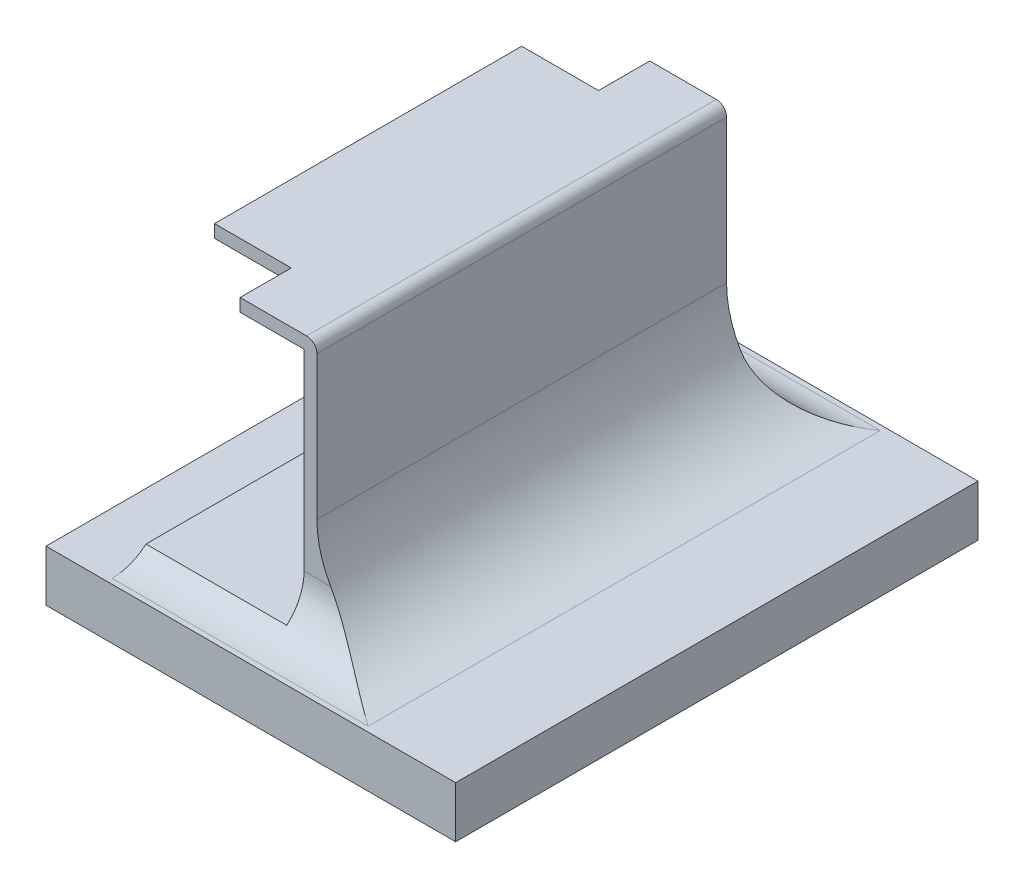
ISO-10303-21;
HEADER;
FILE_DESCRIPTION(('STEP AP214'),'2;1');
FILE_NAME('part.step','',(''),(''),'','','');
FILE_SCHEMA(('AUTOMOTIVE_DESIGN { 1 0 10303 214 1 1 1 1 }'));
ENDSEC;
DATA;
#1=APPLICATION_CONTEXT('core data for automotive mechanical design processes');
#2=APPLICATION_PROTOCOL_DEFINITION('international standard','automotive_design',2000,#1);
#3=PRODUCT_CONTEXT('',#1,'mechanical');
#4=PRODUCT('Part','Part','',(#3));
#5=PRODUCT_RELATED_PRODUCT_CATEGORY('part','',(#4));
#6=PRODUCT_DEFINITION_FORMATION('','',#4);
#7=PRODUCT_DEFINITION_CONTEXT('part definition',#1,'design');
#8=PRODUCT_DEFINITION('design','',#6,#7);
#9=PRODUCT_DEFINITION_SHAPE('','',#8);
#10=(LENGTH_UNIT() NAMED_UNIT(*) SI_UNIT(.MILLI.,.METRE.));
#11=(NAMED_UNIT(*) PLANE_ANGLE_UNIT() SI_UNIT($,.RADIAN.));
#12=(NAMED_UNIT(*) SI_UNIT($,.STERADIAN.) SOLID_ANGLE_UNIT());
#13=UNCERTAINTY_MEASURE_WITH_UNIT(LENGTH_MEASURE(1.E-05),#10,'distance_accuracy_value','');
#14=(GEOMETRIC_REPRESENTATION_CONTEXT(3) GLOBAL_UNCERTAINTY_ASSIGNED_CONTEXT((#13)) GLOBAL_UNIT_ASSIGNED_CONTEXT((#10,
#11,#12)) REPRESENTATION_CONTEXT('',''));
#15=CARTESIAN_POINT('',(0.,0.,0.));
#16=DIRECTION('',(0.,0.,1.));
#17=DIRECTION('',(1.,0.,0.));
#18=AXIS2_PLACEMENT_3D('',#15,#16,#17);
#19=CARTESIAN_POINT('',(0.65,0.575,0.3));
#20=DIRECTION('',(0.,0.,-1.));
#21=DIRECTION('',(-1.,0.,0.));
#22=AXIS2_PLACEMENT_3D('',#19,#20,#21);
#23=PLANE('',#22);
#24=DIRECTION('',(0.,1.,0.));
#25=VECTOR('',#24,1.);
#26=CARTESIAN_POINT('',(0.65,0.575,0.3));
#27=LINE('',#26,#25);
#28=CARTESIAN_POINT('',(0.65,0.575,0.3));
#29=VERTEX_POINT('',#28);
#30=CARTESIAN_POINT('',(0.649999999986111,0.6,0.3));
#31=VERTEX_POINT('',#30);
#32=EDGE_CURVE('E206',#29,#31,#27,.T.);
#33=ORIENTED_EDGE('',*,*,#32,.T.);
#34=DIRECTION('',(1.,0.,0.));
#35=VECTOR('',#34,1.);
#36=CARTESIAN_POINT('',(0.5,0.6,0.3));
#37=LINE('',#36,#35);
#38=CARTESIAN_POINT('',(0.5,0.6,0.3));
#39=VERTEX_POINT('',#38);
#40=EDGE_CURVE('E205',#31,#39,#37,.F.);
#41=ORIENTED_EDGE('',*,*,#40,.T.);
#42=DIRECTION('',(0.,1.,0.));
#43=VECTOR('',#42,1.);
#44=CARTESIAN_POINT('',(0.5,0.575,0.3));
#45=LINE('',#44,#43);
#46=CARTESIAN_POINT('',(0.5,0.575,0.3));
#47=VERTEX_POINT('',#46);
#48=EDGE_CURVE('E252',#39,#47,#45,.F.);
#49=ORIENTED_EDGE('',*,*,#48,.T.);
#50=DIRECTION('',(1.,0.,0.));
#51=VECTOR('',#50,1.);
#52=CARTESIAN_POINT('',(0.5,0.575,0.3));
#53=LINE('',#52,#51);
#54=EDGE_CURVE('E226',#47,#29,#53,.T.);
#55=ORIENTED_EDGE('',*,*,#54,.T.);
#56=EDGE_LOOP('',(#33,#41,#49,#55));
#57=FACE_BOUND('',#56,.T.);
#58=ADVANCED_FACE('F17',(#57),#23,.F.);
#59=CARTESIAN_POINT('',(0.5,0.575,0.3));
#60=DIRECTION('',(1.,0.,0.));
#61=DIRECTION('',(0.,0.,-1.));
#62=AXIS2_PLACEMENT_3D('',#59,#60,#61);
#63=PLANE('',#62);
#64=DIRECTION('',(0.,1.,0.));
#65=VECTOR('',#64,1.);
#66=CARTESIAN_POINT('',(0.5,0.575,-0.3));
#67=LINE('',#66,#65);
#68=CARTESIAN_POINT('',(0.5,0.6,-0.3));
#69=VERTEX_POINT('',#68);
#70=CARTESIAN_POINT('',(0.5,0.575,-0.3));
#71=VERTEX_POINT('',#70);
#72=EDGE_CURVE('E245',#69,#71,#67,.F.);
#73=ORIENTED_EDGE('',*,*,#72,.T.);
#74=DIRECTION('',(0.,0.,1.));
#75=VECTOR('',#74,1.);
#76=CARTESIAN_POINT('',(0.5,0.575,-0.4));
#77=LINE('',#76,#75);
#78=EDGE_CURVE('E236',#71,#47,#77,.T.);
#79=ORIENTED_EDGE('',*,*,#78,.T.);
#80=ORIENTED_EDGE('',*,*,#48,.F.);
#81=DIRECTION('',(0.,0.,-1.));
#82=VECTOR('',#81,1.);
#83=CARTESIAN_POINT('',(0.5,0.6,0.4));
#84=LINE('',#83,#82);
#85=EDGE_CURVE('E240',#39,#69,#84,.T.);
#86=ORIENTED_EDGE('',*,*,#85,.T.);
#87=EDGE_LOOP('',(#73,#79,#80,#86));
#88=FACE_BOUND('',#87,.T.);
#89=ADVANCED_FACE('F578',(#88),#63,.F.);
#90=CARTESIAN_POINT('',(0.5,0.575,-0.3));
#91=DIRECTION('',(0.,0.,1.));
#92=DIRECTION('',(1.,0.,0.));
#93=AXIS2_PLACEMENT_3D('',#90,#91,#92);
#94=PLANE('',#93);
#95=ORIENTED_EDGE('',*,*,#72,.F.);
#96=DIRECTION('',(1.,0.,0.));
#97=VECTOR('',#96,1.);
#98=CARTESIAN_POINT('',(0.5,0.6,-0.3));
#99=LINE('',#98,#97);
#100=CARTESIAN_POINT('',(0.650000000008889,0.6,-0.3));
#101=VERTEX_POINT('',#100);
#102=EDGE_CURVE('E232',#69,#101,#99,.T.);
#103=ORIENTED_EDGE('',*,*,#102,.T.);
#104=DIRECTION('',(0.,1.,0.));
#105=VECTOR('',#104,1.);
#106=CARTESIAN_POINT('',(0.65,0.575,-0.3));
#107=LINE('',#106,#105);
#108=CARTESIAN_POINT('',(0.649999999990741,0.575,-0.3));
#109=VERTEX_POINT('',#108);
#110=EDGE_CURVE('E243',#101,#109,#107,.F.);
#111=ORIENTED_EDGE('',*,*,#110,.T.);
#112=DIRECTION('',(1.,0.,0.));
#113=VECTOR('',#112,1.);
#114=CARTESIAN_POINT('',(0.5,0.575,-0.3));
#115=LINE('',#114,#113);
#116=EDGE_CURVE('E225',#109,#71,#115,.F.);
#117=ORIENTED_EDGE('',*,*,#116,.T.);
#118=EDGE_LOOP('',(#95,#103,#111,#117));
#119=FACE_BOUND('',#118,.T.);
#120=ADVANCED_FACE('F569',(#119),#94,.F.);
#121=CARTESIAN_POINT('',(0.65,0.575,-0.3));
#122=DIRECTION('',(1.,0.,0.));
#123=DIRECTION('',(0.,0.,-1.));
#124=AXIS2_PLACEMENT_3D('',#121,#122,#123);
#125=PLANE('',#124);
#126=ORIENTED_EDGE('',*,*,#110,.F.);
#127=DIRECTION('',(0.,0.,-1.));
#128=VECTOR('',#127,1.);
#129=CARTESIAN_POINT('',(0.650000000013333,0.6,0.4));
#130=LINE('',#129,#128);
#131=CARTESIAN_POINT('',(0.649999999990556,0.6,-0.4));
#132=VERTEX_POINT('',#131);
#133=EDGE_CURVE('E193',#101,#132,#130,.T.);
#134=ORIENTED_EDGE('',*,*,#133,.T.);
#135=DIRECTION('',(0.,1.,0.));
#136=VECTOR('',#135,1.);
#137=CARTESIAN_POINT('',(0.649999999979167,0.2,-0.4));
#138=LINE('',#137,#136);
#139=CARTESIAN_POINT('',(0.649999999979167,0.575,-0.4));
#140=VERTEX_POINT('',#139);
#141=EDGE_CURVE('E165',#140,#132,#138,.T.);
#142=ORIENTED_EDGE('',*,*,#141,.F.);
#143=DIRECTION('',(0.,0.,1.));
#144=VECTOR('',#143,1.);
#145=CARTESIAN_POINT('',(0.649999999979167,0.575,-0.4));
#146=LINE('',#145,#144);
#147=EDGE_CURVE('E222',#140,#109,#146,.T.);
#148=ORIENTED_EDGE('',*,*,#147,.T.);
#149=EDGE_LOOP('',(#126,#134,#142,#148));
#150=FACE_BOUND('',#149,.T.);
#151=ADVANCED_FACE('F560',(#150),#125,.F.);
#152=CARTESIAN_POINT('',(0.5,0.575,-0.4));
#153=DIRECTION('',(0.,1.,0.));
#154=DIRECTION('',(0.,0.,1.));
#155=AXIS2_PLACEMENT_3D('',#152,#153,#154);
#156=PLANE('',#155);
#157=ORIENTED_EDGE('',*,*,#116,.F.);
#158=ORIENTED_EDGE('',*,*,#147,.F.);
#159=DIRECTION('',(-1.,0.,0.));
#160=VECTOR('',#159,1.);
#161=CARTESIAN_POINT('',(0.827855689,0.575,-0.4));
#162=LINE('',#161,#160);
#163=CARTESIAN_POINT('',(0.775000000036869,0.575,-0.4));
#164=VERTEX_POINT('',#163);
#165=EDGE_CURVE('E174',#164,#140,#162,.T.);
#166=ORIENTED_EDGE('',*,*,#165,.F.);
#167=DIRECTION('',(0.,0.,-1.));
#168=VECTOR('',#167,1.);
#169=CARTESIAN_POINT('',(0.775,0.575,0.439062492));
#170=LINE('',#169,#168);
#171=CARTESIAN_POINT('',(0.775000000023,0.575,0.400000000028376));
#172=VERTEX_POINT('',#171);
#173=EDGE_CURVE('E213',#164,#172,#170,.F.);
#174=ORIENTED_EDGE('',*,*,#173,.T.);
#175=DIRECTION('',(-1.,0.,0.));
#176=VECTOR('',#175,1.);
#177=CARTESIAN_POINT('',(0.827855689,0.575,0.4));
#178=LINE('',#177,#176);
#179=CARTESIAN_POINT('',(0.649999999979167,0.575,0.4));
#180=VERTEX_POINT('',#179);
#181=EDGE_CURVE('E199',#172,#180,#178,.T.);
#182=ORIENTED_EDGE('',*,*,#181,.T.);
#183=DIRECTION('',(0.,0.,-1.));
#184=VECTOR('',#183,1.);
#185=CARTESIAN_POINT('',(0.65,0.575,0.4));
#186=LINE('',#185,#184);
#187=EDGE_CURVE('E202',#180,#29,#186,.T.);
#188=ORIENTED_EDGE('',*,*,#187,.T.);
#189=ORIENTED_EDGE('',*,*,#54,.F.);
#190=ORIENTED_EDGE('',*,*,#78,.F.);
#191=EDGE_LOOP('',(#157,#158,#166,#174,#182,#188,#189,#190));
#192=FACE_BOUND('',#191,.T.);
#193=ADVANCED_FACE('F551',(#192),#156,.F.);
#194=CARTESIAN_POINT('',(0.65,0.575,0.4));
#195=DIRECTION('',(1.,0.,0.));
#196=DIRECTION('',(0.,0.,-1.));
#197=AXIS2_PLACEMENT_3D('',#194,#195,#196);
#198=PLANE('',#197);
#199=DIRECTION('',(0.,1.,0.));
#200=VECTOR('',#199,1.);
#201=CARTESIAN_POINT('',(0.64999999996875,0.2,0.4));
#202=LINE('',#201,#200);
#203=CARTESIAN_POINT('',(0.649999999972222,0.6,0.4));
#204=VERTEX_POINT('',#203);
#205=EDGE_CURVE('E196',#180,#204,#202,.T.);
#206=ORIENTED_EDGE('',*,*,#205,.T.);
#207=DIRECTION('',(0.,0.,-1.));
#208=VECTOR('',#207,1.);
#209=CARTESIAN_POINT('',(0.649999999979167,0.6,0.4));
#210=LINE('',#209,#208);
#211=EDGE_CURVE('E190',#204,#31,#210,.T.);
#212=ORIENTED_EDGE('',*,*,#211,.T.);
#213=ORIENTED_EDGE('',*,*,#32,.F.);
#214=ORIENTED_EDGE('',*,*,#187,.F.);
#215=EDGE_LOOP('',(#206,#212,#213,#214));
#216=FACE_BOUND('',#215,.T.);
#217=ADVANCED_FACE('F543',(#216),#198,.F.);
#218=CARTESIAN_POINT('',(0.5,0.6,0.4));
#219=DIRECTION('',(0.,-1.,0.));
#220=DIRECTION('',(0.,0.,-1.));
#221=AXIS2_PLACEMENT_3D('',#218,#219,#220);
#222=PLANE('',#221);
#223=DIRECTION('',(-1.,0.,0.));
#224=VECTOR('',#223,1.);
#225=CARTESIAN_POINT('',(0.827855689,0.6,0.4));
#226=LINE('',#225,#224);
#227=CARTESIAN_POINT('',(0.78,0.6,0.4));
#228=VERTEX_POINT('',#227);
#229=EDGE_CURVE('E198',#204,#228,#226,.F.);
#230=ORIENTED_EDGE('',*,*,#229,.T.);
#231=DIRECTION('',(0.,0.,-1.));
#232=VECTOR('',#231,1.);
#233=CARTESIAN_POINT('',(0.78,0.6,0.4));
#234=LINE('',#233,#232);
#235=CARTESIAN_POINT('',(0.78,0.6,-0.4));
#236=VERTEX_POINT('',#235);
#237=EDGE_CURVE('E151',#236,#228,#234,.F.);
#238=ORIENTED_EDGE('',*,*,#237,.F.);
#239=DIRECTION('',(-1.,0.,0.));
#240=VECTOR('',#239,1.);
#241=CARTESIAN_POINT('',(0.827855689,0.6,-0.4));
#242=LINE('',#241,#240);
#243=EDGE_CURVE('E179',#132,#236,#242,.F.);
#244=ORIENTED_EDGE('',*,*,#243,.F.);
#245=ORIENTED_EDGE('',*,*,#133,.F.);
#246=ORIENTED_EDGE('',*,*,#102,.F.);
#247=ORIENTED_EDGE('',*,*,#85,.F.);
#248=ORIENTED_EDGE('',*,*,#40,.F.);
#249=ORIENTED_EDGE('',*,*,#211,.F.);
#250=EDGE_LOOP('',(#230,#238,#244,#245,#246,#247,#248,#249));
#251=FACE_BOUND('',#250,.T.);
#252=ADVANCED_FACE('F535',(#251),#222,.F.);
#253=CARTESIAN_POINT('',(0.78,0.58,0.4));
#254=DIRECTION('',(0.,0.,-1.));
#255=DIRECTION('',(-1.,0.,0.));
#256=AXIS2_PLACEMENT_3D('',#253,#254,#255);
#257=CYLINDRICAL_SURFACE('',#256,0.0199999999999999);
#258=ORIENTED_EDGE('',*,*,#237,.T.);
#259=CARTESIAN_POINT('',(0.78,0.58,0.4));
#260=DIRECTION('',(0.,0.,-1.));
#261=DIRECTION('',(-1.,0.,0.));
#262=AXIS2_PLACEMENT_3D('',#259,#260,#261);
#263=CIRCLE('',#262,0.0199999999999999);
#264=CARTESIAN_POINT('',(0.8,0.58,0.4));
#265=VERTEX_POINT('',#264);
#266=EDGE_CURVE('E162',#228,#265,#263,.T.);
#267=ORIENTED_EDGE('',*,*,#266,.T.);
#268=DIRECTION('',(0.,0.,1.));
#269=VECTOR('',#268,1.);
#270=CARTESIAN_POINT('',(0.8,0.58,-0.4));
#271=LINE('',#270,#269);
#272=CARTESIAN_POINT('',(0.800000000021836,0.58,-0.4));
#273=VERTEX_POINT('',#272);
#274=EDGE_CURVE('E156',#265,#273,#271,.F.);
#275=ORIENTED_EDGE('',*,*,#274,.T.);
#276=CARTESIAN_POINT('',(0.78,0.58,-0.4));
#277=DIRECTION('',(0.,0.,-1.));
#278=DIRECTION('',(-1.,0.,0.));
#279=AXIS2_PLACEMENT_3D('',#276,#277,#278);
#280=CIRCLE('',#279,0.0199999999999999);
#281=EDGE_CURVE('E20',#236,#273,#280,.T.);
#282=ORIENTED_EDGE('',*,*,#281,.F.);
#283=EDGE_LOOP('',(#258,#267,#275,#282));
#284=FACE_BOUND('',#283,.T.);
#285=ADVANCED_FACE('F158',(#284),#257,.T.);
#286=CARTESIAN_POINT('',(0.8,0.58,-0.4));
#287=DIRECTION('',(-1.,0.,0.));
#288=DIRECTION('',(0.,0.,1.));
#289=AXIS2_PLACEMENT_3D('',#286,#287,#288);
#290=PLANE('',#289);
#291=ORIENTED_EDGE('',*,*,#274,.F.);
#292=DIRECTION('',(0.,1.,0.));
#293=VECTOR('',#292,1.);
#294=CARTESIAN_POINT('',(0.8,0.2,0.4));
#295=LINE('',#294,#293);
#296=CARTESIAN_POINT('',(0.8,0.3,0.400000000000027));
#297=VERTEX_POINT('',#296);
#298=EDGE_CURVE('E318',#265,#297,#295,.F.);
#299=ORIENTED_EDGE('',*,*,#298,.T.);
#300=DIRECTION('',(0.,0.,1.));
#301=VECTOR('',#300,1.);
#302=CARTESIAN_POINT('',(0.8,0.3,-0.506));
#303=LINE('',#302,#301);
#304=CARTESIAN_POINT('',(0.800000000021836,0.3,-0.400000000004));
#305=VERTEX_POINT('',#304);
#306=EDGE_CURVE('E171',#297,#305,#303,.F.);
#307=ORIENTED_EDGE('',*,*,#306,.T.);
#308=DIRECTION('',(0.,1.,0.));
#309=VECTOR('',#308,1.);
#310=CARTESIAN_POINT('',(0.800000000043671,0.2,-0.4));
#311=LINE('',#310,#309);
#312=EDGE_CURVE('E168',#273,#305,#311,.F.);
#313=ORIENTED_EDGE('',*,*,#312,.F.);
#314=EDGE_LOOP('',(#291,#299,#307,#313));
#315=FACE_BOUND('',#314,.T.);
#316=ADVANCED_FACE('F169',(#315),#290,.F.);
#317=CARTESIAN_POINT('',(0.827855689,0.2,-0.4));
#318=DIRECTION('',(0.,0.,-1.));
#319=DIRECTION('',(-1.,0.,0.));
#320=AXIS2_PLACEMENT_3D('',#317,#318,#319);
#321=PLANE('',#320);
#322=DIRECTION('',(0.,1.,0.));
#323=VECTOR('',#322,1.);
#324=CARTESIAN_POINT('',(0.775,0.125,-0.4));
#325=LINE('',#324,#323);
#326=CARTESIAN_POINT('',(0.775000000055303,0.200000000006281,-0.4));
#327=VERTEX_POINT('',#326);
#328=EDGE_CURVE('E215',#327,#164,#325,.T.);
#329=ORIENTED_EDGE('',*,*,#328,.T.);
#330=ORIENTED_EDGE('',*,*,#165,.T.);
#331=ORIENTED_EDGE('',*,*,#141,.T.);
#332=ORIENTED_EDGE('',*,*,#243,.T.);
#333=ORIENTED_EDGE('',*,*,#281,.T.);
#334=ORIENTED_EDGE('',*,*,#312,.T.);
#335=CARTESIAN_POINT('',(1.,0.3,-0.400000000004));
#336=DIRECTION('',(0.,0.,1.));
#337=DIRECTION('',(1.,0.,0.));
#338=AXIS2_PLACEMENT_3D('',#335,#336,#337);
#339=CIRCLE('',#338,0.2);
#340=CARTESIAN_POINT('',(0.826794919235461,0.200000000011846,-0.400000000001054));
#341=VERTEX_POINT('',#340);
#342=EDGE_CURVE('E316',#305,#341,#339,.T.);
#343=ORIENTED_EDGE('',*,*,#342,.T.);
#344=DIRECTION('',(1.,0.,0.));
#345=VECTOR('',#344,1.);
#346=CARTESIAN_POINT('',(0.5,0.200000000012562,-0.4));
#347=LINE('',#346,#345);
#348=EDGE_CURVE('E312',#341,#327,#347,.F.);
#349=ORIENTED_EDGE('',*,*,#348,.T.);
#350=EDGE_LOOP('',(#329,#330,#331,#332,#333,#334,#343,#349));
#351=FACE_BOUND('',#350,.T.);
#352=ADVANCED_FACE('F177',(#351),#321,.T.);
#353=CARTESIAN_POINT('',(0.775,0.125,0.439062492));
#354=DIRECTION('',(1.,0.,0.));
#355=DIRECTION('',(0.,0.,-1.));
#356=AXIS2_PLACEMENT_3D('',#353,#354,#355);
#357=PLANE('',#356);
#358=CARTESIAN_POINT('',(0.775000000023,0.2,0.5));
#359=DIRECTION('',(-1.,0.,0.));
#360=DIRECTION('',(0.,0.,1.));
#361=AXIS2_PLACEMENT_3D('',#358,#359,#360);
#362=CIRCLE('',#361,0.1);
#363=CARTESIAN_POINT('',(0.775000000039151,0.125000000005154,0.433856217211698));
#364=VERTEX_POINT('',#363);
#365=CARTESIAN_POINT('',(0.77500000002875,0.2,0.4));
#366=VERTEX_POINT('',#365);
#367=EDGE_CURVE('E284',#364,#366,#362,.F.);
#368=ORIENTED_EDGE('',*,*,#367,.T.);
#369=DIRECTION('',(0.,1.,0.));
#370=VECTOR('',#369,1.);
#371=CARTESIAN_POINT('',(0.7750000000345,0.2,0.4));
#372=LINE('',#371,#370);
#373=EDGE_CURVE('E210',#366,#172,#372,.T.);
#374=ORIENTED_EDGE('',*,*,#373,.T.);
#375=ORIENTED_EDGE('',*,*,#173,.F.);
#376=ORIENTED_EDGE('',*,*,#328,.F.);
#377=CARTESIAN_POINT('',(0.775000000110606,0.2,-0.5));
#378=DIRECTION('',(1.,0.,0.));
#379=DIRECTION('',(0.,0.,-1.));
#380=AXIS2_PLACEMENT_3D('',#377,#378,#379);
#381=CIRCLE('',#380,0.1);
#382=CARTESIAN_POINT('',(0.775000000082955,0.124999999998918,-0.433856217225838));
#383=VERTEX_POINT('',#382);
#384=EDGE_CURVE('E313',#327,#383,#381,.T.);
#385=ORIENTED_EDGE('',*,*,#384,.T.);
#386=DIRECTION('',(0.,0.,-1.));
#387=VECTOR('',#386,1.);
#388=CARTESIAN_POINT('',(0.775000000055303,0.125,0.433856217));
#389=LINE('',#388,#387);
#390=EDGE_CURVE('E317',#383,#364,#389,.F.);
#391=ORIENTED_EDGE('',*,*,#390,.T.);
#392=EDGE_LOOP('',(#368,#374,#375,#376,#385,#391));
#393=FACE_BOUND('',#392,.T.);
#394=ADVANCED_FACE('F506',(#393),#357,.F.);
#395=CARTESIAN_POINT('',(0.827855689,0.2,0.4));
#396=DIRECTION('',(0.,0.,-1.));
#397=DIRECTION('',(-1.,0.,0.));
#398=AXIS2_PLACEMENT_3D('',#395,#396,#397);
#399=PLANE('',#398);
#400=ORIENTED_EDGE('',*,*,#298,.F.);
#401=ORIENTED_EDGE('',*,*,#266,.F.);
#402=ORIENTED_EDGE('',*,*,#229,.F.);
#403=ORIENTED_EDGE('',*,*,#205,.F.);
#404=ORIENTED_EDGE('',*,*,#181,.F.);
#405=ORIENTED_EDGE('',*,*,#373,.F.);
#406=DIRECTION('',(-1.,0.,0.));
#407=VECTOR('',#406,1.);
#408=CARTESIAN_POINT('',(1.003,0.2,0.4));
#409=LINE('',#408,#407);
#410=CARTESIAN_POINT('',(0.826794919243862,0.199999999998,0.400000000000027));
#411=VERTEX_POINT('',#410);
#412=EDGE_CURVE('E283',#366,#411,#409,.F.);
#413=ORIENTED_EDGE('',*,*,#412,.T.);
#414=CARTESIAN_POINT('',(1.,0.3,0.400000000000054));
#415=DIRECTION('',(0.,0.,1.));
#416=DIRECTION('',(1.,0.,0.));
#417=AXIS2_PLACEMENT_3D('',#414,#415,#416);
#418=CIRCLE('',#417,0.2);
#419=EDGE_CURVE('E187',#411,#297,#418,.F.);
#420=ORIENTED_EDGE('',*,*,#419,.T.);
#421=EDGE_LOOP('',(#400,#401,#402,#403,#404,#405,#413,#420));
#422=FACE_BOUND('',#421,.T.);
#423=ADVANCED_FACE('F370',(#422),#399,.F.);
#424=CARTESIAN_POINT('',(0.5,0.125,0.433856217));
#425=DIRECTION('',(0.,-1.,0.));
#426=DIRECTION('',(0.,0.,-1.));
#427=AXIS2_PLACEMENT_3D('',#424,#425,#426);
#428=PLANE('',#427);
#429=DIRECTION('',(-1.,0.,0.));
#430=VECTOR('',#429,1.);
#431=CARTESIAN_POINT('',(1.003,0.125000000020615,0.433856217200011));
#432=LINE('',#431,#430);
#433=CARTESIAN_POINT('',(0.5,0.125000000003993,0.433856217218857));
#434=VERTEX_POINT('',#433);
#435=EDGE_CURVE('E275',#434,#364,#432,.F.);
#436=ORIENTED_EDGE('',*,*,#435,.T.);
#437=ORIENTED_EDGE('',*,*,#390,.F.);
#438=DIRECTION('',(1.,0.,0.));
#439=VECTOR('',#438,1.);
#440=CARTESIAN_POINT('',(0.5,0.124999999995673,-0.433856217228291));
#441=LINE('',#440,#439);
#442=CARTESIAN_POINT('',(0.5,0.124999999991523,-0.433856217232998));
#443=VERTEX_POINT('',#442);
#444=EDGE_CURVE('E334',#383,#443,#441,.F.);
#445=ORIENTED_EDGE('',*,*,#444,.T.);
#446=DIRECTION('',(0.,0.,-1.));
#447=VECTOR('',#446,1.);
#448=CARTESIAN_POINT('',(0.5,0.124999999987372,0.506));
#449=LINE('',#448,#447);
#450=EDGE_CURVE('E340',#443,#434,#449,.F.);
#451=ORIENTED_EDGE('',*,*,#450,.T.);
#452=EDGE_LOOP('',(#436,#437,#445,#451));
#453=FACE_BOUND('',#452,.T.);
#454=ADVANCED_FACE('F493',(#453),#428,.F.);
#455=CARTESIAN_POINT('',(1.,0.3,-0.506));
#456=DIRECTION('',(0.,0.,1.));
#457=DIRECTION('',(1.,0.,0.));
#458=AXIS2_PLACEMENT_3D('',#455,#456,#457);
#459=CYLINDRICAL_SURFACE('',#458,0.2);
#460=ORIENTED_EDGE('',*,*,#419,.F.);
#461=CARTESIAN_POINT('',(0.826794919245219,0.19999999999635,0.4));
#462=CARTESIAN_POINT('',(0.83112053080877,0.192485690399696,0.400008857800515));
#463=CARTESIAN_POINT('',(0.835916451417255,0.185326558494217,0.40084269301661));
#464=CARTESIAN_POINT('',(0.846163216293374,0.171925193453775,0.403779236334651));
#465=CARTESIAN_POINT('',(0.85160419643604,0.165671750272969,0.405864418299191));
#466=CARTESIAN_POINT('',(0.864070184368493,0.152971591018438,0.411426534381074));
#467=CARTESIAN_POINT('',(0.871199452055782,0.146715187138145,0.415092977770635));
#468=CARTESIAN_POINT('',(0.885961995065693,0.13543352691315,0.423317803120075));
#469=CARTESIAN_POINT('',(0.893598068172302,0.130415977703925,0.427881466361019));
#470=CARTESIAN_POINT('',(0.91234089640699,0.119793250205556,0.439567119275444));
#471=CARTESIAN_POINT('',(0.923599763507991,0.114774375141445,0.446976253707024));
#472=CARTESIAN_POINT('',(0.94641091774354,0.106936347923723,0.462398506986867));
#473=CARTESIAN_POINT('',(0.957962784578813,0.104114210572105,0.470410789896464));
#474=CARTESIAN_POINT('',(0.978923226484742,0.100889583872477,0.485101135740876));
#475=CARTESIAN_POINT('',(0.988308747217825,0.100121610173948,0.491733388485922));
#476=CARTESIAN_POINT('',(0.998460423973696,0.10000444919043,0.498911355870459));
#477=CARTESIAN_POINT('',(0.999230237064578,0.100000006341012,0.499455696073852));
#478=CARTESIAN_POINT('',(1.,0.1,0.5));
#479=B_SPLINE_CURVE_WITH_KNOTS('',3,(#461,#462,#463,#464,#465,#466,#467,#468,#469,#470,#471,
#472,#473,#474,#475,#476,#477,#478),.UNSPECIFIED.,.F.,.F.,(4,2,2,2,2,2,2,2,4),(0.,
0.025848435767527,0.0513430265915071,0.0816965683549554,0.112234438632135,0.155151467054056,
0.198010072213491,0.232479852219109,0.23530831077353),.UNSPECIFIED.);
#480=CARTESIAN_POINT('',(0.999999999949444,0.1,0.499999999979931));
#481=VERTEX_POINT('',#480);
#482=EDGE_CURVE('E276',#411,#481,#479,.T.);
#483=ORIENTED_EDGE('',*,*,#482,.T.);
#484=DIRECTION('',(0.,0.,-1.));
#485=VECTOR('',#484,1.);
#486=CARTESIAN_POINT('',(0.999999999942053,0.1,0.51));
#487=LINE('',#486,#485);
#488=CARTESIAN_POINT('',(0.999999999971027,0.1,-0.499999999940893));
#489=VERTEX_POINT('',#488);
#490=EDGE_CURVE('E350',#481,#489,#487,.T.);
#491=ORIENTED_EDGE('',*,*,#490,.T.);
#492=CARTESIAN_POINT('',(1.,0.1,-0.5));
#493=CARTESIAN_POINT('',(0.999999999950757,0.0999999999999989,-0.499999611087571));
#494=CARTESIAN_POINT('',(0.999999960309637,0.100000000002983,-0.499999222180235));
#495=CARTESIAN_POINT('',(0.999999819833158,0.100000000013576,-0.499998455075247));
#496=CARTESIAN_POINT('',(0.999999718739186,0.100000000021206,-0.499998076929965));
#497=CARTESIAN_POINT('',(0.999999467705695,0.100000000040176,-0.499997328561973));
#498=CARTESIAN_POINT('',(0.999999316766788,0.100000000051591,-0.499996958682193));
#499=CARTESIAN_POINT('',(0.999998977816325,0.100000000077261,-0.499996237298116));
#500=CARTESIAN_POINT('',(0.999998789844402,0.100000000091512,-0.499995885774677));
#501=CARTESIAN_POINT('',(0.999998151350813,0.100000000139996,-0.499994796371705));
#502=CARTESIAN_POINT('',(0.99999765092133,0.100000000178102,-0.49999408755909));
#503=CARTESIAN_POINT('',(0.999996570049613,0.100000000260817,-0.499992746657266));
#504=CARTESIAN_POINT('',(0.999995990256866,0.100000000305374,-0.499992114016522));
#505=CARTESIAN_POINT('',(0.99999391616441,0.100000000465772,-0.499989998024733));
#506=CARTESIAN_POINT('',(0.999992317996965,0.100000000591055,-0.499988615314596));
#507=CARTESIAN_POINT('',(0.999989012927042,0.10000000085552,-0.4999861283856));
#508=CARTESIAN_POINT('',(0.999987311715668,0.100000000994068,-0.499985016173272));
#509=CARTESIAN_POINT('',(0.99998070596603,0.10000000154339,-0.499980827873058));
#510=CARTESIAN_POINT('',(0.999975695915881,0.100000001983733,-0.499977923941996));
#511=CARTESIAN_POINT('',(0.999965954329992,0.100000003132285,-0.499972776158037));
#512=CARTESIAN_POINT('',(0.99996124253154,0.100000003810566,-0.499970495655661));
#513=CARTESIAN_POINT('',(0.99993027449326,0.100000009470078,-0.499954207358652));
#514=CARTESIAN_POINT('',(0.99990682806375,0.100000019693332,-0.499935451209513));
#515=CARTESIAN_POINT('',(0.999819738982969,0.10000007277886,-0.499868898492914));
#516=CARTESIAN_POINT('',(0.999754070284215,0.100000141647518,-0.499824659324673));
#517=CARTESIAN_POINT('',(0.999513857789269,0.100000511234241,-0.499659861584533));
#518=CARTESIAN_POINT('',(0.999341361617858,0.100001007082031,-0.499535697587748));
#519=CARTESIAN_POINT('',(0.998677533931127,0.100003777447637,-0.499060830210729));
#520=CARTESIAN_POINT('',(0.998184017664401,0.100007645906599,-0.498714006150791));
#521=CARTESIAN_POINT('',(0.9905591670761,0.100095541169794,-0.493352209904531));
#522=CARTESIAN_POINT('',(0.983445439070934,0.100557819227995,-0.488304578293413));
#523=CARTESIAN_POINT('',(0.968715928854648,0.102312815134541,-0.477928778182384));
#524=CARTESIAN_POINT('',(0.961102357875459,0.103665013663881,-0.472607836231599));
#525=CARTESIAN_POINT('',(0.947405353533808,0.106936326254387,-0.463132622700171));
#526=CARTESIAN_POINT('',(0.941305466760091,0.108699370490281,-0.458948407676327));
#527=CARTESIAN_POINT('',(0.929298390450943,0.112808026085937,-0.450827450726562));
#528=CARTESIAN_POINT('',(0.923389686513819,0.115143288853166,-0.446887721614248));
#529=CARTESIAN_POINT('',(0.909315972316054,0.121511885907001,-0.437691027385914));
#530=CARTESIAN_POINT('',(0.901209931684844,0.125849618658978,-0.432549460538511));
#531=CARTESIAN_POINT('',(0.885077743273509,0.136027399077003,-0.42280577952382));
#532=CARTESIAN_POINT('',(0.877065729898019,0.141917234893535,-0.418230773719464));
#533=CARTESIAN_POINT('',(0.863778764165818,0.153376357776948,-0.411355036515902));
#534=CARTESIAN_POINT('',(0.858351102336313,0.158598843592378,-0.408774050086849));
#535=CARTESIAN_POINT('',(0.848013888168205,0.169779195460674,-0.40449004324408));
#536=CARTESIAN_POINT('',(0.843100114255373,0.175730023562761,-0.402779333697915));
#537=CARTESIAN_POINT('',(0.834902731937157,0.186950289326019,-0.400728546166575));
#538=CARTESIAN_POINT('',(0.831496184093592,0.192089575461383,-0.400172330351397));
#539=CARTESIAN_POINT('',(0.825160487884552,0.202690155173211,-0.399895807646621));
#540=CARTESIAN_POINT('',(0.822231753627316,0.208151722539392,-0.400176221825415));
#541=CARTESIAN_POINT('',(0.816918291438751,0.219258267520922,-0.401710947829042));
#542=CARTESIAN_POINT('',(0.814537755490152,0.224904304336692,-0.402972460978123));
#543=CARTESIAN_POINT('',(0.810394020729201,0.236085524417218,-0.40655381113907));
#544=CARTESIAN_POINT('',(0.808630265972195,0.241620803249557,-0.408872690711332));
#545=CARTESIAN_POINT('',(0.805883862889613,0.251603155580046,-0.414181297020485));
#546=CARTESIAN_POINT('',(0.804829530236469,0.256098206008114,-0.417044829891167));
#547=CARTESIAN_POINT('',(0.803106485363544,0.26461855375908,-0.423495256924665));
#548=CARTESIAN_POINT('',(0.802437764365187,0.268643861774152,-0.427082134617791));
#549=CARTESIAN_POINT('',(0.801413901663433,0.275980105313328,-0.434773275029535));
#550=CARTESIAN_POINT('',(0.801050779002098,0.279307397695329,-0.438860948868122));
#551=CARTESIAN_POINT('',(0.800519613122905,0.285282891890224,-0.447516709243242));
#552=CARTESIAN_POINT('',(0.800351593770941,0.287931010592742,-0.45208485447863));
#553=CARTESIAN_POINT('',(0.800123991798605,0.292568902932394,-0.461776728419297));
#554=CARTESIAN_POINT('',(0.800069101956163,0.294527487609981,-0.466915503910398));
#555=CARTESIAN_POINT('',(0.80000882513186,0.297577220573214,-0.477444752234399));
#556=CARTESIAN_POINT('',(0.800003444239286,0.298668262141464,-0.482835255946334));
#557=CARTESIAN_POINT('',(0.799998878478011,0.299968217650134,-0.493850262684544));
#558=CARTESIAN_POINT('',(0.799999841748612,0.300155862581577,-0.499477289081228));
#559=CARTESIAN_POINT('',(0.800000241561195,0.299585869135832,-0.510683449628154));
#560=CARTESIAN_POINT('',(0.799999678007652,0.298828171614764,-0.516262580759915));
#561=CARTESIAN_POINT('',(0.800028952051117,0.296386102641876,-0.527227501771367));
#562=CARTESIAN_POINT('',(0.800058858189019,0.29469964589631,-0.532612827415568));
#563=CARTESIAN_POINT('',(0.800217025275677,0.290446712173501,-0.543023315354239));
#564=CARTESIAN_POINT('',(0.800345291366429,0.28788018919263,-0.548048458804331));
#565=CARTESIAN_POINT('',(0.800793471713846,0.281958341973783,-0.55756817875496));
#566=CARTESIAN_POINT('',(0.801112460241678,0.278606875186651,-0.562065193354219));
#567=CARTESIAN_POINT('',(0.802046850777513,0.27121875215446,-0.570419829992819));
#568=CARTESIAN_POINT('',(0.802662148035391,0.267182338376027,-0.574277677341265));
#569=CARTESIAN_POINT('',(0.80426178612915,0.258714830300239,-0.581124818547735));
#570=CARTESIAN_POINT('',(0.805233370433814,0.254301007857318,-0.584138435407934));
#571=CARTESIAN_POINT('',(0.807612497367612,0.245142152255433,-0.589386945818724));
#572=CARTESIAN_POINT('',(0.809019889676545,0.240397233735598,-0.591622107312518));
#573=CARTESIAN_POINT('',(0.812245856406524,0.230915583590433,-0.595232133694325));
#574=CARTESIAN_POINT('',(0.814049920257968,0.226183396775241,-0.596632112604746));
#575=CARTESIAN_POINT('',(0.818081645256309,0.216740777788967,-0.598707374607518));
#576=CARTESIAN_POINT('',(0.820309515497531,0.212030357536895,-0.599382298880793));
#577=CARTESIAN_POINT('',(0.825286281036745,0.202503347427084,-0.600089105766047));
#578=CARTESIAN_POINT('',(0.828057441505848,0.197695699992215,-0.600082664142484));
#579=CARTESIAN_POINT('',(0.833962080969042,0.188366933762365,-0.599431120689722));
#580=CARTESIAN_POINT('',(0.837095222818916,0.183845554322634,-0.598786608981011));
#581=CARTESIAN_POINT('',(0.845339923167057,0.172925776543115,-0.5964988705745));
#582=CARTESIAN_POINT('',(0.85064598790899,0.166745111718743,-0.594514061398149));
#583=CARTESIAN_POINT('',(0.861805269387901,0.155197818045603,-0.589624745966487));
#584=CARTESIAN_POINT('',(0.867663793747403,0.149840739581501,-0.586710503446962));
#585=CARTESIAN_POINT('',(0.88238894282894,0.137848508449974,-0.578797851596849));
#586=CARTESIAN_POINT('',(0.89144758006182,0.131683873068247,-0.57344601396098));
#587=CARTESIAN_POINT('',(0.909611715514509,0.121296277318067,-0.562146275150674));
#588=CARTESIAN_POINT('',(0.918699653850915,0.117003329574732,-0.556232345935757));
#589=CARTESIAN_POINT('',(0.933025483703562,0.111467581711108,-0.546664550389309));
#590=CARTESIAN_POINT('',(0.938182224042145,0.109716632368019,-0.543172364193356));
#591=CARTESIAN_POINT('',(0.948641616574635,0.106628357629541,-0.536016279853844));
#592=CARTESIAN_POINT('',(0.953945245373413,0.105298773587451,-0.532350449720539));
#593=CARTESIAN_POINT('',(0.965864198722438,0.10281968511778,-0.524061904481932));
#594=CARTESIAN_POINT('',(0.972490501504934,0.101788878929114,-0.519419609233472));
#595=CARTESIAN_POINT('',(0.985303688948704,0.100443766254518,-0.51038311285586));
#596=CARTESIAN_POINT('',(0.991489257583479,0.100084822822337,-0.505993967934314));
#597=CARTESIAN_POINT('',(0.998183744060762,0.100007648802347,-0.501286168951242));
#598=CARTESIAN_POINT('',(0.998677001692416,0.10000378158636,-0.500939540916848));
#599=CARTESIAN_POINT('',(0.999340753985608,0.10000100892682,-0.500464731604119));
#600=CARTESIAN_POINT('',(0.999513435748229,0.100000512090173,-0.500340432441936));
#601=CARTESIAN_POINT('',(0.999753897164182,0.100000141842306,-0.500175464870375));
#602=CARTESIAN_POINT('',(0.999819626251157,0.100000072864609,-0.500131185456525));
#603=CARTESIAN_POINT('',(0.999906787132085,0.100000019709986,-0.500064576750916));
#604=CARTESIAN_POINT('',(0.999930247306963,0.100000009476331,-0.500045809400647));
#605=CARTESIAN_POINT('',(0.999961233156025,0.100000003812412,-0.500029513823041));
#606=CARTESIAN_POINT('',(0.999965946613808,0.100000003133773,-0.500027232832981));
#607=CARTESIAN_POINT('',(0.999975691580852,0.100000001984627,-0.500022083458261));
#608=CARTESIAN_POINT('',(0.999980703320657,0.100000001544074,-0.500019178361086));
#609=CARTESIAN_POINT('',(0.999987310981879,0.100000000994498,-0.500014988385991));
#610=CARTESIAN_POINT('',(0.999989012526854,0.100000000855896,-0.500013875819398));
#611=CARTESIAN_POINT('',(0.999992318181233,0.100000000591325,-0.500011388044377));
#612=CARTESIAN_POINT('',(0.999993916594516,0.100000000465988,-0.500010004836655));
#613=CARTESIAN_POINT('',(0.999995990901381,0.100000000305521,-0.500007888111924));
#614=CARTESIAN_POINT('',(0.999996570727201,0.100000000260946,-0.500007255272416));
#615=CARTESIAN_POINT('',(0.99999765162373,0.100000000178195,-0.500005913953696));
#616=CARTESIAN_POINT('',(0.999998152044471,0.100000000140073,-0.500005204922695));
#617=CARTESIAN_POINT('',(0.999998790478716,0.100000000091566,-0.500004115201829));
#618=CARTESIAN_POINT('',(0.999998978423868,0.100000000077308,-0.500003763581413));
#619=CARTESIAN_POINT('',(0.999999317304834,0.100000000051626,-0.500003042003673));
#620=CARTESIAN_POINT('',(0.999999468200984,0.100000000040204,-0.500002672027201));
#621=CARTESIAN_POINT('',(0.999999719129701,0.100000000021224,-0.50000192347369));
#622=CARTESIAN_POINT('',(0.999999820162299,0.10000000001359,-0.500001545239578));
#623=CARTESIAN_POINT('',(0.999999960492667,0.100000000002988,-0.500000777967044));
#624=CARTESIAN_POINT('',(1.00000000004925,0.100000000000001,-0.500000388980975));
#625=CARTESIAN_POINT('',(1.,0.1,-0.5));
#626=B_SPLINE_CURVE_WITH_KNOTS('',3,(#492,#493,#494,#495,#496,#497,#498,#499,#500,#501,#502,
#503,#504,#505,#506,#507,#508,#509,#510,#511,#512,#513,#514,#515,#516,#517,#518,#519,#520,#521,
#522,#523,#524,#525,#526,#527,#528,#529,#530,#531,#532,#533,#534,#535,#536,#537,#538,#539,#540,
#541,#542,#543,#544,#545,#546,#547,#548,#549,#550,#551,#552,#553,#554,#555,#556,#557,#558,#559,
#560,#561,#562,#563,#564,#565,#566,#567,#568,#569,#570,#571,#572,#573,#574,#575,#576,#577,#578,
#579,#580,#581,#582,#583,#584,#585,#586,#587,#588,#589,#590,#591,#592,#593,#594,#595,#596,#597,
#598,#599,#600,#601,#602,#603,#604,#605,#606,#607,#608,#609,#610,#611,#612,#613,#614,#615,#616,
#617,#618,#619,#620,#621,#622,#623,#624,#625),.UNSPECIFIED.,.T.,.F.,(4,2,2,2,2,2,2,2,2,2,2,2,2,
2,2,2,2,2,2,2,2,2,2,2,2,2,2,2,2,2,2,2,2,2,2,2,2,2,2,2,2,2,2,2,2,2,2,2,2,2,2,2,2,2,2,2,2,2,2,2,2,
2,2,2,2,2,4),(0.,1.1657418881177E-06,2.33642389301832E-06,3.53216875800322E-06,
4.72664080584895E-06,7.31837980065784E-06,9.89005249106383E-06,1.62011914754866E-05,
2.22935161321232E-05,3.96531852215082E-05,5.53386783199896E-05,0.000144735683186955,
0.000382746776118468,0.00101979383593593,0.00282995284943068,0.0289916399693866,
0.0571085116449638,0.0798951122089926,0.102296631108115,0.133802525849213,0.166477896941627,
0.190285571152318,0.213879076556719,0.232380257612565,0.250897388932745,0.269551734863555,
0.288189222825265,0.304406842604821,0.3206240931704,0.336403371911894,0.352184580640956,
0.368608224210914,0.385033887758276,0.401844436549602,0.418656037119512,0.435505538688526,
0.452355921164409,0.469125171742465,0.48588849845503,0.50210239995845,0.518310715132278,
0.53400322498838,0.549703497268626,0.566287295052442,0.582855769589937,0.607868118390411,
0.633151600312128,0.669528404698787,0.704394938115908,0.723788896525696,0.743520889215854,
0.767961857665613,0.790711880509482,0.792521066221139,0.793158800880314,0.793397030493589,
0.793486479926429,0.793502170520055,0.793519536288507,0.793525630027879,0.793531942677173,
0.793534514855062,0.793537107107704,0.793538301797785,0.793539497761385,0.793540668651642,
0.793541834598992),.UNSPECIFIED.);
#627=EDGE_CURVE('E186',#489,#341,#626,.T.);
#628=ORIENTED_EDGE('',*,*,#627,.T.);
#629=ORIENTED_EDGE('',*,*,#342,.F.);
#630=ORIENTED_EDGE('',*,*,#306,.F.);
#631=EDGE_LOOP('',(#460,#483,#491,#628,#629,#630));
#632=FACE_BOUND('',#631,.T.);
#633=ADVANCED_FACE('F286',(#632),#459,.F.);
#634=CARTESIAN_POINT('',(0.5,0.2,-0.5));
#635=DIRECTION('',(1.,0.,0.));
#636=DIRECTION('',(0.,0.,-1.));
#637=AXIS2_PLACEMENT_3D('',#634,#635,#636);
#638=CYLINDRICAL_SURFACE('',#637,0.1);
#639=ORIENTED_EDGE('',*,*,#384,.F.);
#640=ORIENTED_EDGE('',*,*,#348,.F.);
#641=ORIENTED_EDGE('',*,*,#627,.F.);
#642=DIRECTION('',(1.,0.,0.));
#643=VECTOR('',#642,1.);
#644=CARTESIAN_POINT('',(0.381,0.1,-0.499999999881786));
#645=LINE('',#644,#643);
#646=CARTESIAN_POINT('',(0.5,0.1,-0.499999999940893));
#647=VERTEX_POINT('',#646);
#648=EDGE_CURVE('E347',#489,#647,#645,.F.);
#649=ORIENTED_EDGE('',*,*,#648,.T.);
#650=CARTESIAN_POINT('',(0.5,0.2,-0.5));
#651=DIRECTION('',(1.,0.,0.));
#652=DIRECTION('',(0.,0.,-1.));
#653=AXIS2_PLACEMENT_3D('',#650,#651,#652);
#654=CIRCLE('',#653,0.1);
#655=EDGE_CURVE('E335',#647,#443,#654,.F.);
#656=ORIENTED_EDGE('',*,*,#655,.T.);
#657=ORIENTED_EDGE('',*,*,#444,.F.);
#658=EDGE_LOOP('',(#639,#640,#641,#649,#656,#657));
#659=FACE_BOUND('',#658,.T.);
#660=ADVANCED_FACE('F300',(#659),#638,.F.);
#661=CARTESIAN_POINT('',(0.5,0.1,0.506));
#662=DIRECTION('',(1.,0.,0.));
#663=DIRECTION('',(0.,0.,-1.));
#664=AXIS2_PLACEMENT_3D('',#661,#662,#663);
#665=PLANE('',#664);
#666=CARTESIAN_POINT('',(0.5,0.2,0.5));
#667=DIRECTION('',(-1.,0.,0.));
#668=DIRECTION('',(0.,0.,1.));
#669=AXIS2_PLACEMENT_3D('',#666,#667,#668);
#670=CIRCLE('',#669,0.1);
#671=CARTESIAN_POINT('',(0.5,0.1,0.499999999995192));
#672=VERTEX_POINT('',#671);
#673=EDGE_CURVE('E272',#672,#434,#670,.F.);
#674=ORIENTED_EDGE('',*,*,#673,.T.);
#675=ORIENTED_EDGE('',*,*,#450,.F.);
#676=ORIENTED_EDGE('',*,*,#655,.F.);
#677=DIRECTION('',(0.,0.,-1.));
#678=VECTOR('',#677,1.);
#679=CARTESIAN_POINT('',(0.5,0.1,0.51));
#680=LINE('',#679,#678);
#681=EDGE_CURVE('E357',#647,#672,#680,.F.);
#682=ORIENTED_EDGE('',*,*,#681,.T.);
#683=EDGE_LOOP('',(#674,#675,#676,#682));
#684=FACE_BOUND('',#683,.T.);
#685=ADVANCED_FACE('F296',(#684),#665,.F.);
#686=CARTESIAN_POINT('',(1.003,0.2,0.5));
#687=DIRECTION('',(-1.,0.,0.));
#688=DIRECTION('',(0.,0.,1.));
#689=AXIS2_PLACEMENT_3D('',#686,#687,#688);
#690=CYLINDRICAL_SURFACE('',#689,0.1);
#691=ORIENTED_EDGE('',*,*,#673,.F.);
#692=DIRECTION('',(1.,0.,0.));
#693=VECTOR('',#692,1.);
#694=CARTESIAN_POINT('',(0.381,0.1,0.499999999990383));
#695=LINE('',#694,#693);
#696=EDGE_CURVE('E361',#672,#481,#695,.T.);
#697=ORIENTED_EDGE('',*,*,#696,.T.);
#698=ORIENTED_EDGE('',*,*,#482,.F.);
#699=ORIENTED_EDGE('',*,*,#412,.F.);
#700=ORIENTED_EDGE('',*,*,#367,.F.);
#701=ORIENTED_EDGE('',*,*,#435,.F.);
#702=EDGE_LOOP('',(#691,#697,#698,#699,#700,#701));
#703=FACE_BOUND('',#702,.T.);
#704=ADVANCED_FACE('F290',(#703),#690,.F.);
#705=CARTESIAN_POINT('',(0.381,0.1,0.51));
#706=DIRECTION('',(0.,-1.,0.));
#707=DIRECTION('',(0.,0.,-1.));
#708=AXIS2_PLACEMENT_3D('',#705,#706,#707);
#709=PLANE('',#708);
#710=ORIENTED_EDGE('',*,*,#681,.F.);
#711=ORIENTED_EDGE('',*,*,#648,.F.);
#712=ORIENTED_EDGE('',*,*,#490,.F.);
#713=ORIENTED_EDGE('',*,*,#696,.F.);
#714=EDGE_LOOP('',(#710,#711,#712,#713));
#715=FACE_BOUND('',#714,.T.);
#716=DIRECTION('',(1.,0.,0.));
#717=VECTOR('',#716,1.);
#718=CARTESIAN_POINT('',(0.381,0.1,-0.51));
#719=LINE('',#718,#717);
#720=CARTESIAN_POINT('',(1.181,0.1,-0.51));
#721=VERTEX_POINT('',#720);
#722=CARTESIAN_POINT('',(0.381,0.1,-0.51));
#723=VERTEX_POINT('',#722);
#724=EDGE_CURVE('E384',#721,#723,#719,.F.);
#725=ORIENTED_EDGE('',*,*,#724,.T.);
#726=DIRECTION('',(0.,0.,-1.));
#727=VECTOR('',#726,1.);
#728=CARTESIAN_POINT('',(0.381,0.1,0.51));
#729=LINE('',#728,#727);
#730=CARTESIAN_POINT('',(0.381,0.1,0.51));
#731=VERTEX_POINT('',#730);
#732=EDGE_CURVE('E364',#723,#731,#729,.F.);
#733=ORIENTED_EDGE('',*,*,#732,.T.);
#734=DIRECTION('',(-1.,0.,0.));
#735=VECTOR('',#734,1.);
#736=CARTESIAN_POINT('',(1.181,0.1,0.51));
#737=LINE('',#736,#735);
#738=CARTESIAN_POINT('',(1.181,0.1,0.51));
#739=VERTEX_POINT('',#738);
#740=EDGE_CURVE('E407',#731,#739,#737,.F.);
#741=ORIENTED_EDGE('',*,*,#740,.T.);
#742=DIRECTION('',(0.,0.,1.));
#743=VECTOR('',#742,1.);
#744=CARTESIAN_POINT('',(1.181,0.1,-0.51));
#745=LINE('',#744,#743);
#746=EDGE_CURVE('E388',#739,#721,#745,.F.);
#747=ORIENTED_EDGE('',*,*,#746,.T.);
#748=EDGE_LOOP('',(#725,#733,#741,#747));
#749=FACE_BOUND('',#748,.T.);
#750=ADVANCED_FACE('F295',(#715,#749),#709,.F.);
#751=CARTESIAN_POINT('',(0.381,0.,0.51));
#752=DIRECTION('',(1.,0.,0.));
#753=DIRECTION('',(0.,0.,-1.));
#754=AXIS2_PLACEMENT_3D('',#751,#752,#753);
#755=PLANE('',#754);
#756=DIRECTION('',(0.,1.,0.));
#757=VECTOR('',#756,1.);
#758=CARTESIAN_POINT('',(0.381,0.,-0.51));
#759=LINE('',#758,#757);
#760=CARTESIAN_POINT('',(0.381,0.,-0.51));
#761=VERTEX_POINT('',#760);
#762=EDGE_CURVE('E392',#723,#761,#759,.F.);
#763=ORIENTED_EDGE('',*,*,#762,.T.);
#764=DIRECTION('',(0.,0.,-1.));
#765=VECTOR('',#764,1.);
#766=CARTESIAN_POINT('',(0.381,0.,0.51));
#767=LINE('',#766,#765);
#768=CARTESIAN_POINT('',(0.381,0.,0.51));
#769=VERTEX_POINT('',#768);
#770=EDGE_CURVE('E409',#769,#761,#767,.T.);
#771=ORIENTED_EDGE('',*,*,#770,.F.);
#772=DIRECTION('',(0.,1.,0.));
#773=VECTOR('',#772,1.);
#774=CARTESIAN_POINT('',(0.381,0.,0.51));
#775=LINE('',#774,#773);
#776=EDGE_CURVE('E405',#769,#731,#775,.T.);
#777=ORIENTED_EDGE('',*,*,#776,.T.);
#778=ORIENTED_EDGE('',*,*,#732,.F.);
#779=EDGE_LOOP('',(#763,#771,#777,#778));
#780=FACE_BOUND('',#779,.T.);
#781=ADVANCED_FACE('F381',(#780),#755,.F.);
#782=CARTESIAN_POINT('',(0.381,0.,-0.51));
#783=DIRECTION('',(0.,0.,1.));
#784=DIRECTION('',(1.,0.,0.));
#785=AXIS2_PLACEMENT_3D('',#782,#783,#784);
#786=PLANE('',#785);
#787=DIRECTION('',(0.,1.,0.));
#788=VECTOR('',#787,1.);
#789=CARTESIAN_POINT('',(1.181,0.,-0.51));
#790=LINE('',#789,#788);
#791=CARTESIAN_POINT('',(1.181,0.,-0.51));
#792=VERTEX_POINT('',#791);
#793=EDGE_CURVE('E391',#721,#792,#790,.F.);
#794=ORIENTED_EDGE('',*,*,#793,.T.);
#795=DIRECTION('',(1.,0.,0.));
#796=VECTOR('',#795,1.);
#797=CARTESIAN_POINT('',(0.381,0.,-0.51));
#798=LINE('',#797,#796);
#799=EDGE_CURVE('E397',#761,#792,#798,.T.);
#800=ORIENTED_EDGE('',*,*,#799,.F.);
#801=ORIENTED_EDGE('',*,*,#762,.F.);
#802=ORIENTED_EDGE('',*,*,#724,.F.);
#803=EDGE_LOOP('',(#794,#800,#801,#802));
#804=FACE_BOUND('',#803,.T.);
#805=ADVANCED_FACE('F395',(#804),#786,.F.);
#806=CARTESIAN_POINT('',(1.181,0.,-0.51));
#807=DIRECTION('',(-1.,0.,0.));
#808=DIRECTION('',(0.,0.,1.));
#809=AXIS2_PLACEMENT_3D('',#806,#807,#808);
#810=PLANE('',#809);
#811=DIRECTION('',(0.,1.,0.));
#812=VECTOR('',#811,1.);
#813=CARTESIAN_POINT('',(1.181,0.,0.51));
#814=LINE('',#813,#812);
#815=CARTESIAN_POINT('',(1.181,0.,0.51));
#816=VERTEX_POINT('',#815);
#817=EDGE_CURVE('E35',#739,#816,#814,.F.);
#818=ORIENTED_EDGE('',*,*,#817,.T.);
#819=DIRECTION('',(0.,0.,-1.));
#820=VECTOR('',#819,1.);
#821=CARTESIAN_POINT('',(1.181,0.,0.51));
#822=LINE('',#821,#820);
#823=EDGE_CURVE('E26',#792,#816,#822,.F.);
#824=ORIENTED_EDGE('',*,*,#823,.F.);
#825=ORIENTED_EDGE('',*,*,#793,.F.);
#826=ORIENTED_EDGE('',*,*,#746,.F.);
#827=EDGE_LOOP('',(#818,#824,#825,#826));
#828=FACE_BOUND('',#827,.T.);
#829=ADVANCED_FACE('F415',(#828),#810,.F.);
#830=CARTESIAN_POINT('',(1.181,0.,0.51));
#831=DIRECTION('',(0.,0.,-1.));
#832=DIRECTION('',(-1.,0.,0.));
#833=AXIS2_PLACEMENT_3D('',#830,#831,#832);
#834=PLANE('',#833);
#835=ORIENTED_EDGE('',*,*,#776,.F.);
#836=DIRECTION('',(1.,0.,0.));
#837=VECTOR('',#836,1.);
#838=CARTESIAN_POINT('',(0.381,0.,0.51));
#839=LINE('',#838,#837);
#840=EDGE_CURVE('E11',#816,#769,#839,.F.);
#841=ORIENTED_EDGE('',*,*,#840,.F.);
#842=ORIENTED_EDGE('',*,*,#817,.F.);
#843=ORIENTED_EDGE('',*,*,#740,.F.);
#844=EDGE_LOOP('',(#835,#841,#842,#843));
#845=FACE_BOUND('',#844,.T.);
#846=ADVANCED_FACE('F419',(#845),#834,.F.);
#847=CARTESIAN_POINT('',(0.381,0.,0.51));
#848=DIRECTION('',(0.,-1.,0.));
#849=DIRECTION('',(0.,0.,-1.));
#850=AXIS2_PLACEMENT_3D('',#847,#848,#849);
#851=PLANE('',#850);
#852=ORIENTED_EDGE('',*,*,#823,.T.);
#853=ORIENTED_EDGE('',*,*,#840,.T.);
#854=ORIENTED_EDGE('',*,*,#770,.T.);
#855=ORIENTED_EDGE('',*,*,#799,.T.);
#856=EDGE_LOOP('',(#852,#853,#854,#855));
#857=FACE_BOUND('',#856,.T.);
#858=ADVANCED_FACE('F414',(#857),#851,.T.);
#859=CLOSED_SHELL('',(#58,#89,#120,#151,#193,#217,#252,#285,#316,#352,#394,#423,#454,#633,#660,
#685,#704,#750,#781,#805,#829,#846,#858));
#860=MANIFOLD_SOLID_BREP('B1',#859);
#861=ADVANCED_BREP_SHAPE_REPRESENTATION('',(#18,#860),#14);
#862=SHAPE_DEFINITION_REPRESENTATION(#9,#861);
ENDSEC;
END-ISO-10303-21;
